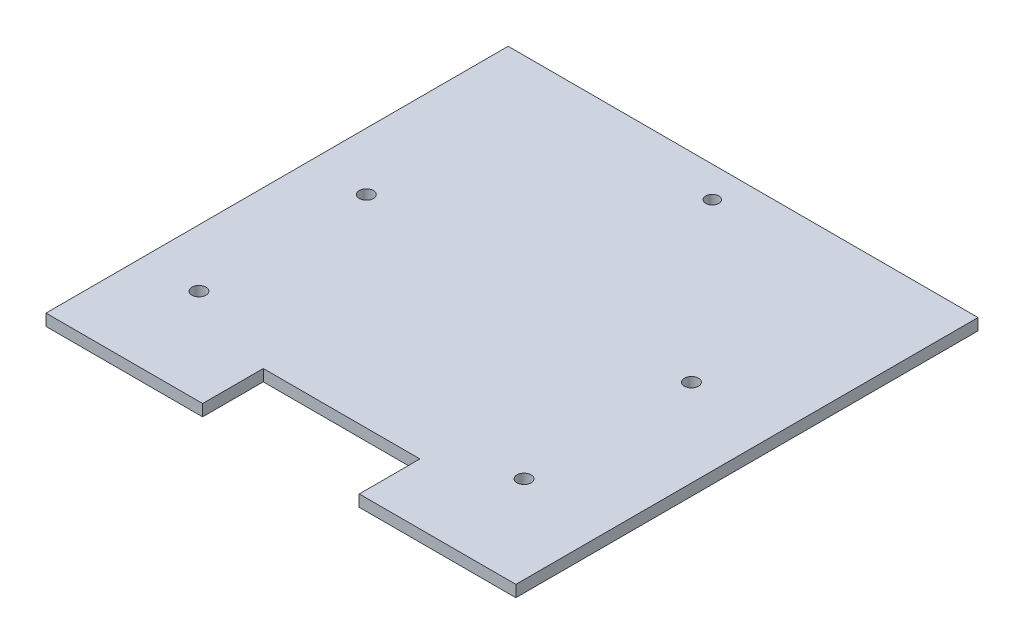
ISO-10303-21;
HEADER;
FILE_DESCRIPTION(('STEP AP214'),'2;1');
FILE_NAME('part.step','',(''),(''),'','','');
FILE_SCHEMA(('AUTOMOTIVE_DESIGN { 1 0 10303 214 1 1 1 1 }'));
ENDSEC;
DATA;
#1=APPLICATION_CONTEXT('core data for automotive mechanical design processes');
#2=APPLICATION_PROTOCOL_DEFINITION('international standard','automotive_design',2000,#1);
#3=PRODUCT_CONTEXT('',#1,'mechanical');
#4=PRODUCT('Part','Part','',(#3));
#5=PRODUCT_RELATED_PRODUCT_CATEGORY('part','',(#4));
#6=PRODUCT_DEFINITION_FORMATION('','',#4);
#7=PRODUCT_DEFINITION_CONTEXT('part definition',#1,'design');
#8=PRODUCT_DEFINITION('design','',#6,#7);
#9=PRODUCT_DEFINITION_SHAPE('','',#8);
#10=(LENGTH_UNIT() NAMED_UNIT(*) SI_UNIT(.MILLI.,.METRE.));
#11=(NAMED_UNIT(*) PLANE_ANGLE_UNIT() SI_UNIT($,.RADIAN.));
#12=(NAMED_UNIT(*) SI_UNIT($,.STERADIAN.) SOLID_ANGLE_UNIT());
#13=UNCERTAINTY_MEASURE_WITH_UNIT(LENGTH_MEASURE(1.E-05),#10,'distance_accuracy_value','');
#14=(GEOMETRIC_REPRESENTATION_CONTEXT(3) GLOBAL_UNCERTAINTY_ASSIGNED_CONTEXT((#13)) GLOBAL_UNIT_ASSIGNED_CONTEXT((#10,
#11,#12)) REPRESENTATION_CONTEXT('',''));
#15=CARTESIAN_POINT('',(0.,0.,0.));
#16=DIRECTION('',(0.,0.,1.));
#17=DIRECTION('',(1.,0.,0.));
#18=AXIS2_PLACEMENT_3D('',#15,#16,#17);
#19=CARTESIAN_POINT('',(-96.84,4.78,95.25));
#20=DIRECTION('',(0.,0.,-1.));
#21=DIRECTION('',(-1.,0.,0.));
#22=AXIS2_PLACEMENT_3D('',#19,#20,#21);
#23=PLANE('',#22);
#24=DIRECTION('',(1.,0.,0.));
#25=VECTOR('',#24,1.);
#26=CARTESIAN_POINT('',(-96.84,0.,95.25));
#27=LINE('',#26,#25);
#28=CARTESIAN_POINT('',(-96.84,0.,95.25));
#29=VERTEX_POINT('',#28);
#30=CARTESIAN_POINT('',(-32.28,0.,95.25));
#31=VERTEX_POINT('',#30);
#32=EDGE_CURVE('E134',#29,#31,#27,.T.);
#33=ORIENTED_EDGE('',*,*,#32,.T.);
#34=DIRECTION('',(0.,1.,0.));
#35=VECTOR('',#34,1.);
#36=CARTESIAN_POINT('',(-32.28,0.,95.25));
#37=LINE('',#36,#35);
#38=CARTESIAN_POINT('',(-32.28,4.78,95.25));
#39=VERTEX_POINT('',#38);
#40=EDGE_CURVE('E165',#31,#39,#37,.T.);
#41=ORIENTED_EDGE('',*,*,#40,.T.);
#42=DIRECTION('',(1.,0.,0.));
#43=VECTOR('',#42,1.);
#44=CARTESIAN_POINT('',(-96.84,4.78,95.25));
#45=LINE('',#44,#43);
#46=CARTESIAN_POINT('',(-96.84,4.78,95.25));
#47=VERTEX_POINT('',#46);
#48=EDGE_CURVE('E149',#47,#39,#45,.T.);
#49=ORIENTED_EDGE('',*,*,#48,.F.);
#50=DIRECTION('',(0.,-1.,0.));
#51=VECTOR('',#50,1.);
#52=CARTESIAN_POINT('',(-96.84,4.78,95.25));
#53=LINE('',#52,#51);
#54=EDGE_CURVE('E148',#47,#29,#53,.T.);
#55=ORIENTED_EDGE('',*,*,#54,.T.);
#56=EDGE_LOOP('',(#33,#41,#49,#55));
#57=FACE_BOUND('',#56,.T.);
#58=ADVANCED_FACE('F39',(#57),#23,.F.);
#59=CARTESIAN_POINT('',(96.84,4.78,95.25));
#60=DIRECTION('',(-1.,0.,0.));
#61=DIRECTION('',(0.,0.,1.));
#62=AXIS2_PLACEMENT_3D('',#59,#60,#61);
#63=PLANE('',#62);
#64=DIRECTION('',(0.,0.,-1.));
#65=VECTOR('',#64,1.);
#66=CARTESIAN_POINT('',(96.84,0.,95.25));
#67=LINE('',#66,#65);
#68=CARTESIAN_POINT('',(96.84,0.,95.25));
#69=VERTEX_POINT('',#68);
#70=CARTESIAN_POINT('',(96.84,0.,-95.25));
#71=VERTEX_POINT('',#70);
#72=EDGE_CURVE('E132',#69,#71,#67,.T.);
#73=ORIENTED_EDGE('',*,*,#72,.T.);
#74=DIRECTION('',(0.,-1.,0.));
#75=VECTOR('',#74,1.);
#76=CARTESIAN_POINT('',(96.84,4.78,-95.25));
#77=LINE('',#76,#75);
#78=CARTESIAN_POINT('',(96.84,4.78,-95.25));
#79=VERTEX_POINT('',#78);
#80=EDGE_CURVE('E11',#79,#71,#77,.T.);
#81=ORIENTED_EDGE('',*,*,#80,.F.);
#82=DIRECTION('',(0.,0.,-1.));
#83=VECTOR('',#82,1.);
#84=CARTESIAN_POINT('',(96.84,4.78,95.25));
#85=LINE('',#84,#83);
#86=CARTESIAN_POINT('',(96.84,4.78,95.25));
#87=VERTEX_POINT('',#86);
#88=EDGE_CURVE('E140',#87,#79,#85,.T.);
#89=ORIENTED_EDGE('',*,*,#88,.F.);
#90=DIRECTION('',(0.,-1.,0.));
#91=VECTOR('',#90,1.);
#92=CARTESIAN_POINT('',(96.84,4.78,95.25));
#93=LINE('',#92,#91);
#94=EDGE_CURVE('E145',#87,#69,#93,.T.);
#95=ORIENTED_EDGE('',*,*,#94,.T.);
#96=EDGE_LOOP('',(#73,#81,#89,#95));
#97=FACE_BOUND('',#96,.T.);
#98=ADVANCED_FACE('F41',(#97),#63,.F.);
#99=CARTESIAN_POINT('',(-96.84,4.78,-95.25));
#100=DIRECTION('',(0.,0.,1.));
#101=DIRECTION('',(1.,0.,0.));
#102=AXIS2_PLACEMENT_3D('',#99,#100,#101);
#103=PLANE('',#102);
#104=DIRECTION('',(-1.,0.,0.));
#105=VECTOR('',#104,1.);
#106=CARTESIAN_POINT('',(-96.84,0.,-95.25));
#107=LINE('',#106,#105);
#108=CARTESIAN_POINT('',(-96.84,0.,-95.25));
#109=VERTEX_POINT('',#108);
#110=EDGE_CURVE('E141',#71,#109,#107,.T.);
#111=ORIENTED_EDGE('',*,*,#110,.T.);
#112=DIRECTION('',(0.,-1.,0.));
#113=VECTOR('',#112,1.);
#114=CARTESIAN_POINT('',(-96.84,4.78,-95.25));
#115=LINE('',#114,#113);
#116=CARTESIAN_POINT('',(-96.84,4.78,-95.25));
#117=VERTEX_POINT('',#116);
#118=EDGE_CURVE('E48',#117,#109,#115,.T.);
#119=ORIENTED_EDGE('',*,*,#118,.F.);
#120=DIRECTION('',(-1.,0.,0.));
#121=VECTOR('',#120,1.);
#122=CARTESIAN_POINT('',(-96.84,4.78,-95.25));
#123=LINE('',#122,#121);
#124=EDGE_CURVE('E93',#79,#117,#123,.T.);
#125=ORIENTED_EDGE('',*,*,#124,.F.);
#126=ORIENTED_EDGE('',*,*,#80,.T.);
#127=EDGE_LOOP('',(#111,#119,#125,#126));
#128=FACE_BOUND('',#127,.T.);
#129=ADVANCED_FACE('F177',(#128),#103,.F.);
#130=CARTESIAN_POINT('',(-96.84,4.78,95.25));
#131=DIRECTION('',(1.,0.,0.));
#132=DIRECTION('',(0.,0.,-1.));
#133=AXIS2_PLACEMENT_3D('',#130,#131,#132);
#134=PLANE('',#133);
#135=DIRECTION('',(0.,0.,1.));
#136=VECTOR('',#135,1.);
#137=CARTESIAN_POINT('',(-96.84,0.,95.25));
#138=LINE('',#137,#136);
#139=EDGE_CURVE('E135',#109,#29,#138,.T.);
#140=ORIENTED_EDGE('',*,*,#139,.T.);
#141=ORIENTED_EDGE('',*,*,#54,.F.);
#142=DIRECTION('',(0.,0.,1.));
#143=VECTOR('',#142,1.);
#144=CARTESIAN_POINT('',(-96.84,4.78,95.25));
#145=LINE('',#144,#143);
#146=EDGE_CURVE('E159',#117,#47,#145,.T.);
#147=ORIENTED_EDGE('',*,*,#146,.F.);
#148=ORIENTED_EDGE('',*,*,#118,.T.);
#149=EDGE_LOOP('',(#140,#141,#147,#148));
#150=FACE_BOUND('',#149,.T.);
#151=ADVANCED_FACE('F157',(#150),#134,.F.);
#152=CARTESIAN_POINT('',(32.28,4.78,95.25));
#153=VERTEX_POINT('',#152);
#154=EDGE_CURVE('E64',#153,#87,#45,.T.);
#155=ORIENTED_EDGE('',*,*,#154,.F.);
#156=DIRECTION('',(0.,1.,0.));
#157=VECTOR('',#156,1.);
#158=CARTESIAN_POINT('',(32.28,0.,95.25));
#159=LINE('',#158,#157);
#160=CARTESIAN_POINT('',(32.28,0.,95.25));
#161=VERTEX_POINT('',#160);
#162=EDGE_CURVE('E117',#161,#153,#159,.T.);
#163=ORIENTED_EDGE('',*,*,#162,.F.);
#164=EDGE_CURVE('E86',#161,#69,#27,.T.);
#165=ORIENTED_EDGE('',*,*,#164,.T.);
#166=ORIENTED_EDGE('',*,*,#94,.F.);
#167=EDGE_LOOP('',(#155,#163,#165,#166));
#168=FACE_BOUND('',#167,.T.);
#169=ADVANCED_FACE('F123',(#168),#23,.F.);
#170=CARTESIAN_POINT('',(0.,4.78,0.));
#171=DIRECTION('',(0.,-1.,0.));
#172=DIRECTION('',(0.,0.,-1.));
#173=AXIS2_PLACEMENT_3D('',#170,#171,#172);
#174=PLANE('',#173);
#175=CARTESIAN_POINT('',(60.86,4.78,-13.100000038));
#176=DIRECTION('',(0.,1.,0.));
#177=DIRECTION('',(0.,0.,1.));
#178=AXIS2_PLACEMENT_3D('',#175,#176,#177);
#179=CIRCLE('',#178,2.893699953);
#180=CARTESIAN_POINT('',(60.86,4.78,-10.206300085));
#181=VERTEX_POINT('',#180);
#182=EDGE_CURVE('E225',#181,#181,#179,.T.);
#183=ORIENTED_EDGE('',*,*,#182,.F.);
#184=EDGE_LOOP('',(#183));
#185=FACE_BOUND('',#184,.T.);
#186=CARTESIAN_POINT('',(60.86,4.78,55.899999962));
#187=DIRECTION('',(0.,1.,0.));
#188=DIRECTION('',(0.,0.,1.));
#189=AXIS2_PLACEMENT_3D('',#186,#187,#188);
#190=CIRCLE('',#189,2.893699953);
#191=CARTESIAN_POINT('',(60.86,4.78,58.793699915));
#192=VERTEX_POINT('',#191);
#193=EDGE_CURVE('E233',#192,#192,#190,.T.);
#194=ORIENTED_EDGE('',*,*,#193,.F.);
#195=EDGE_LOOP('',(#194));
#196=FACE_BOUND('',#195,.T.);
#197=CARTESIAN_POINT('',(-73.14,4.78,55.899999962));
#198=DIRECTION('',(0.,1.,0.));
#199=DIRECTION('',(0.,0.,1.));
#200=AXIS2_PLACEMENT_3D('',#197,#198,#199);
#201=CIRCLE('',#200,2.893699953);
#202=CARTESIAN_POINT('',(-73.14,4.78,58.793699915));
#203=VERTEX_POINT('',#202);
#204=EDGE_CURVE('E217',#203,#203,#201,.T.);
#205=ORIENTED_EDGE('',*,*,#204,.F.);
#206=EDGE_LOOP('',(#205));
#207=FACE_BOUND('',#206,.T.);
#208=CARTESIAN_POINT('',(-73.14,4.78,-13.100000038));
#209=DIRECTION('',(0.,1.,0.));
#210=DIRECTION('',(0.,0.,1.));
#211=AXIS2_PLACEMENT_3D('',#208,#209,#210);
#212=CIRCLE('',#211,2.893699953);
#213=CARTESIAN_POINT('',(-73.14,4.78,-10.206300085));
#214=VERTEX_POINT('',#213);
#215=EDGE_CURVE('E213',#214,#214,#212,.T.);
#216=ORIENTED_EDGE('',*,*,#215,.F.);
#217=EDGE_LOOP('',(#216));
#218=FACE_BOUND('',#217,.T.);
#219=CARTESIAN_POINT('',(0.,4.78,-82.55));
#220=DIRECTION('',(0.,1.,0.));
#221=DIRECTION('',(0.,0.,1.));
#222=AXIS2_PLACEMENT_3D('',#219,#220,#221);
#223=CIRCLE('',#222,2.6797);
#224=CARTESIAN_POINT('',(0.,4.78,-79.8703));
#225=VERTEX_POINT('',#224);
#226=EDGE_CURVE('E185',#225,#225,#223,.T.);
#227=ORIENTED_EDGE('',*,*,#226,.F.);
#228=EDGE_LOOP('',(#227));
#229=FACE_BOUND('',#228,.T.);
#230=ORIENTED_EDGE('',*,*,#48,.T.);
#231=DIRECTION('',(0.,0.,1.));
#232=VECTOR('',#231,1.);
#233=CARTESIAN_POINT('',(-32.28,4.78,95.25));
#234=LINE('',#233,#232);
#235=CARTESIAN_POINT('',(-32.28,4.78,70.249999962));
#236=VERTEX_POINT('',#235);
#237=EDGE_CURVE('E121',#236,#39,#234,.T.);
#238=ORIENTED_EDGE('',*,*,#237,.F.);
#239=DIRECTION('',(-1.,0.,0.));
#240=VECTOR('',#239,1.);
#241=CARTESIAN_POINT('',(-32.28,4.78,70.249999962));
#242=LINE('',#241,#240);
#243=CARTESIAN_POINT('',(32.28,4.78,70.249999962));
#244=VERTEX_POINT('',#243);
#245=EDGE_CURVE('E201',#244,#236,#242,.T.);
#246=ORIENTED_EDGE('',*,*,#245,.F.);
#247=DIRECTION('',(0.,0.,-1.));
#248=VECTOR('',#247,1.);
#249=CARTESIAN_POINT('',(32.28,4.78,70.249999962));
#250=LINE('',#249,#248);
#251=EDGE_CURVE('E205',#153,#244,#250,.T.);
#252=ORIENTED_EDGE('',*,*,#251,.F.);
#253=ORIENTED_EDGE('',*,*,#154,.T.);
#254=ORIENTED_EDGE('',*,*,#88,.T.);
#255=ORIENTED_EDGE('',*,*,#124,.T.);
#256=ORIENTED_EDGE('',*,*,#146,.T.);
#257=EDGE_LOOP('',(#230,#238,#246,#252,#253,#254,#255,#256));
#258=FACE_BOUND('',#257,.T.);
#259=ADVANCED_FACE('F247',(#185,#196,#207,#218,#229,#258),#174,.F.);
#260=CARTESIAN_POINT('',(0.,0.,0.));
#261=DIRECTION('',(0.,-1.,0.));
#262=DIRECTION('',(0.,0.,-1.));
#263=AXIS2_PLACEMENT_3D('',#260,#261,#262);
#264=PLANE('',#263);
#265=CARTESIAN_POINT('',(60.86,0.,-13.100000038));
#266=DIRECTION('',(0.,1.,0.));
#267=DIRECTION('',(0.,0.,1.));
#268=AXIS2_PLACEMENT_3D('',#265,#266,#267);
#269=CIRCLE('',#268,2.893699953);
#270=CARTESIAN_POINT('',(60.86,0.,-10.206300085));
#271=VERTEX_POINT('',#270);
#272=EDGE_CURVE('E221',#271,#271,#269,.T.);
#273=ORIENTED_EDGE('',*,*,#272,.T.);
#274=EDGE_LOOP('',(#273));
#275=FACE_BOUND('',#274,.T.);
#276=CARTESIAN_POINT('',(60.86,0.,55.899999962));
#277=DIRECTION('',(0.,1.,0.));
#278=DIRECTION('',(0.,0.,1.));
#279=AXIS2_PLACEMENT_3D('',#276,#277,#278);
#280=CIRCLE('',#279,2.893699953);
#281=CARTESIAN_POINT('',(60.86,0.,58.793699915));
#282=VERTEX_POINT('',#281);
#283=EDGE_CURVE('E229',#282,#282,#280,.T.);
#284=ORIENTED_EDGE('',*,*,#283,.T.);
#285=EDGE_LOOP('',(#284));
#286=FACE_BOUND('',#285,.T.);
#287=CARTESIAN_POINT('',(-73.14,0.,55.899999962));
#288=DIRECTION('',(0.,1.,0.));
#289=DIRECTION('',(0.,0.,1.));
#290=AXIS2_PLACEMENT_3D('',#287,#288,#289);
#291=CIRCLE('',#290,2.893699953);
#292=CARTESIAN_POINT('',(-73.14,0.,58.793699915));
#293=VERTEX_POINT('',#292);
#294=EDGE_CURVE('E237',#293,#293,#291,.T.);
#295=ORIENTED_EDGE('',*,*,#294,.T.);
#296=EDGE_LOOP('',(#295));
#297=FACE_BOUND('',#296,.T.);
#298=CARTESIAN_POINT('',(-73.14,0.,-13.100000038));
#299=DIRECTION('',(0.,1.,0.));
#300=DIRECTION('',(0.,0.,1.));
#301=AXIS2_PLACEMENT_3D('',#298,#299,#300);
#302=CIRCLE('',#301,2.893699953);
#303=CARTESIAN_POINT('',(-73.14,0.,-10.206300085));
#304=VERTEX_POINT('',#303);
#305=EDGE_CURVE('E208',#304,#304,#302,.T.);
#306=ORIENTED_EDGE('',*,*,#305,.T.);
#307=EDGE_LOOP('',(#306));
#308=FACE_BOUND('',#307,.T.);
#309=DIRECTION('',(0.,0.,1.));
#310=VECTOR('',#309,1.);
#311=CARTESIAN_POINT('',(-32.28,0.,95.25));
#312=LINE('',#311,#310);
#313=CARTESIAN_POINT('',(-32.28,0.,70.249999962));
#314=VERTEX_POINT('',#313);
#315=EDGE_CURVE('E125',#314,#31,#312,.T.);
#316=ORIENTED_EDGE('',*,*,#315,.T.);
#317=ORIENTED_EDGE('',*,*,#32,.F.);
#318=ORIENTED_EDGE('',*,*,#139,.F.);
#319=ORIENTED_EDGE('',*,*,#110,.F.);
#320=ORIENTED_EDGE('',*,*,#72,.F.);
#321=ORIENTED_EDGE('',*,*,#164,.F.);
#322=DIRECTION('',(0.,0.,-1.));
#323=VECTOR('',#322,1.);
#324=CARTESIAN_POINT('',(32.28,0.,70.249999962));
#325=LINE('',#324,#323);
#326=CARTESIAN_POINT('',(32.28,0.,70.249999962));
#327=VERTEX_POINT('',#326);
#328=EDGE_CURVE('E114',#161,#327,#325,.T.);
#329=ORIENTED_EDGE('',*,*,#328,.T.);
#330=DIRECTION('',(-1.,0.,0.));
#331=VECTOR('',#330,1.);
#332=CARTESIAN_POINT('',(-32.28,0.,70.249999962));
#333=LINE('',#332,#331);
#334=EDGE_CURVE('E55',#327,#314,#333,.T.);
#335=ORIENTED_EDGE('',*,*,#334,.T.);
#336=EDGE_LOOP('',(#316,#317,#318,#319,#320,#321,#329,#335));
#337=FACE_BOUND('',#336,.T.);
#338=CARTESIAN_POINT('',(0.,0.,-82.55));
#339=DIRECTION('',(0.,1.,0.));
#340=DIRECTION('',(0.,0.,1.));
#341=AXIS2_PLACEMENT_3D('',#338,#339,#340);
#342=CIRCLE('',#341,2.6797);
#343=CARTESIAN_POINT('',(0.,0.,-79.8703));
#344=VERTEX_POINT('',#343);
#345=EDGE_CURVE('E175',#344,#344,#342,.T.);
#346=ORIENTED_EDGE('',*,*,#345,.T.);
#347=EDGE_LOOP('',(#346));
#348=FACE_BOUND('',#347,.T.);
#349=ADVANCED_FACE('F129',(#275,#286,#297,#308,#337,#348),#264,.T.);
#350=CARTESIAN_POINT('',(0.,0.,-82.55));
#351=DIRECTION('',(0.,1.,0.));
#352=DIRECTION('',(0.,0.,1.));
#353=AXIS2_PLACEMENT_3D('',#350,#351,#352);
#354=CYLINDRICAL_SURFACE('',#353,2.6797);
#355=ORIENTED_EDGE('',*,*,#345,.F.);
#356=EDGE_LOOP('',(#355));
#357=FACE_BOUND('',#356,.T.);
#358=ORIENTED_EDGE('',*,*,#226,.T.);
#359=EDGE_LOOP('',(#358));
#360=FACE_BOUND('',#359,.T.);
#361=ADVANCED_FACE('F256',(#357,#360),#354,.F.);
#362=CARTESIAN_POINT('',(-32.28,0.,95.25));
#363=DIRECTION('',(-1.,0.,0.));
#364=DIRECTION('',(0.,0.,1.));
#365=AXIS2_PLACEMENT_3D('',#362,#363,#364);
#366=PLANE('',#365);
#367=ORIENTED_EDGE('',*,*,#237,.T.);
#368=ORIENTED_EDGE('',*,*,#40,.F.);
#369=ORIENTED_EDGE('',*,*,#315,.F.);
#370=DIRECTION('',(0.,1.,0.));
#371=VECTOR('',#370,1.);
#372=CARTESIAN_POINT('',(-32.28,0.,70.249999962));
#373=LINE('',#372,#371);
#374=EDGE_CURVE('E194',#314,#236,#373,.T.);
#375=ORIENTED_EDGE('',*,*,#374,.T.);
#376=EDGE_LOOP('',(#367,#368,#369,#375));
#377=FACE_BOUND('',#376,.T.);
#378=ADVANCED_FACE('F258',(#377),#366,.F.);
#379=CARTESIAN_POINT('',(-32.28,0.,70.249999962));
#380=DIRECTION('',(0.,0.,-1.));
#381=DIRECTION('',(-1.,0.,0.));
#382=AXIS2_PLACEMENT_3D('',#379,#380,#381);
#383=PLANE('',#382);
#384=ORIENTED_EDGE('',*,*,#245,.T.);
#385=ORIENTED_EDGE('',*,*,#374,.F.);
#386=ORIENTED_EDGE('',*,*,#334,.F.);
#387=DIRECTION('',(0.,1.,0.));
#388=VECTOR('',#387,1.);
#389=CARTESIAN_POINT('',(32.28,0.,70.249999962));
#390=LINE('',#389,#388);
#391=EDGE_CURVE('E118',#327,#244,#390,.T.);
#392=ORIENTED_EDGE('',*,*,#391,.T.);
#393=EDGE_LOOP('',(#384,#385,#386,#392));
#394=FACE_BOUND('',#393,.T.);
#395=ADVANCED_FACE('F265',(#394),#383,.F.);
#396=CARTESIAN_POINT('',(32.28,0.,70.249999962));
#397=DIRECTION('',(1.,0.,0.));
#398=DIRECTION('',(0.,0.,-1.));
#399=AXIS2_PLACEMENT_3D('',#396,#397,#398);
#400=PLANE('',#399);
#401=ORIENTED_EDGE('',*,*,#251,.T.);
#402=ORIENTED_EDGE('',*,*,#391,.F.);
#403=ORIENTED_EDGE('',*,*,#328,.F.);
#404=ORIENTED_EDGE('',*,*,#162,.T.);
#405=EDGE_LOOP('',(#401,#402,#403,#404));
#406=FACE_BOUND('',#405,.T.);
#407=ADVANCED_FACE('F116',(#406),#400,.F.);
#408=CARTESIAN_POINT('',(-73.14,0.,-13.100000038));
#409=DIRECTION('',(0.,1.,0.));
#410=DIRECTION('',(0.,0.,1.));
#411=AXIS2_PLACEMENT_3D('',#408,#409,#410);
#412=CYLINDRICAL_SURFACE('',#411,2.893699953);
#413=ORIENTED_EDGE('',*,*,#305,.F.);
#414=EDGE_LOOP('',(#413));
#415=FACE_BOUND('',#414,.T.);
#416=ORIENTED_EDGE('',*,*,#215,.T.);
#417=EDGE_LOOP('',(#416));
#418=FACE_BOUND('',#417,.T.);
#419=ADVANCED_FACE('F342',(#415,#418),#412,.F.);
#420=CARTESIAN_POINT('',(-73.14,0.,55.899999962));
#421=DIRECTION('',(0.,1.,0.));
#422=DIRECTION('',(0.,0.,1.));
#423=AXIS2_PLACEMENT_3D('',#420,#421,#422);
#424=CYLINDRICAL_SURFACE('',#423,2.893699953);
#425=ORIENTED_EDGE('',*,*,#294,.F.);
#426=EDGE_LOOP('',(#425));
#427=FACE_BOUND('',#426,.T.);
#428=ORIENTED_EDGE('',*,*,#204,.T.);
#429=EDGE_LOOP('',(#428));
#430=FACE_BOUND('',#429,.T.);
#431=ADVANCED_FACE('F245',(#427,#430),#424,.F.);
#432=CARTESIAN_POINT('',(60.86,0.,55.899999962));
#433=DIRECTION('',(0.,1.,0.));
#434=DIRECTION('',(0.,0.,1.));
#435=AXIS2_PLACEMENT_3D('',#432,#433,#434);
#436=CYLINDRICAL_SURFACE('',#435,2.893699953);
#437=ORIENTED_EDGE('',*,*,#283,.F.);
#438=EDGE_LOOP('',(#437));
#439=FACE_BOUND('',#438,.T.);
#440=ORIENTED_EDGE('',*,*,#193,.T.);
#441=EDGE_LOOP('',(#440));
#442=FACE_BOUND('',#441,.T.);
#443=ADVANCED_FACE('F356',(#439,#442),#436,.F.);
#444=CARTESIAN_POINT('',(60.86,0.,-13.100000038));
#445=DIRECTION('',(0.,1.,0.));
#446=DIRECTION('',(0.,0.,1.));
#447=AXIS2_PLACEMENT_3D('',#444,#445,#446);
#448=CYLINDRICAL_SURFACE('',#447,2.893699953);
#449=ORIENTED_EDGE('',*,*,#272,.F.);
#450=EDGE_LOOP('',(#449));
#451=FACE_BOUND('',#450,.T.);
#452=ORIENTED_EDGE('',*,*,#182,.T.);
#453=EDGE_LOOP('',(#452));
#454=FACE_BOUND('',#453,.T.);
#455=ADVANCED_FACE('F365',(#451,#454),#448,.F.);
#456=CLOSED_SHELL('',(#58,#98,#129,#151,#169,#259,#349,#361,#378,#395,#407,#419,#431,#443,#455));
#457=MANIFOLD_SOLID_BREP('B2',#456);
#458=ADVANCED_BREP_SHAPE_REPRESENTATION('',(#18,#457),#14);
#459=SHAPE_DEFINITION_REPRESENTATION(#9,#458);
ENDSEC;
END-ISO-10303-21;
